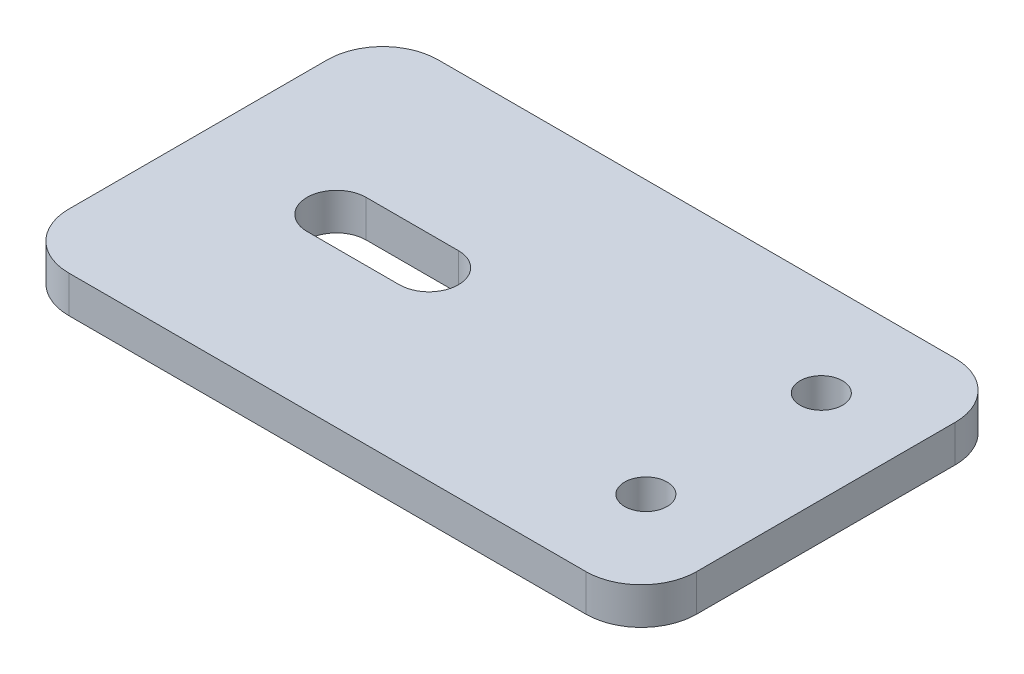
ISO-10303-21;
HEADER;
FILE_DESCRIPTION(('STEP AP214'),'2;1');
FILE_NAME('part.step','',(''),(''),'','','');
FILE_SCHEMA(('AUTOMOTIVE_DESIGN { 1 0 10303 214 1 1 1 1 }'));
ENDSEC;
DATA;
#1=APPLICATION_CONTEXT('core data for automotive mechanical design processes');
#2=APPLICATION_PROTOCOL_DEFINITION('international standard','automotive_design',2000,#1);
#3=PRODUCT_CONTEXT('',#1,'mechanical');
#4=PRODUCT('Part','Part','',(#3));
#5=PRODUCT_RELATED_PRODUCT_CATEGORY('part','',(#4));
#6=PRODUCT_DEFINITION_FORMATION('','',#4);
#7=PRODUCT_DEFINITION_CONTEXT('part definition',#1,'design');
#8=PRODUCT_DEFINITION('design','',#6,#7);
#9=PRODUCT_DEFINITION_SHAPE('','',#8);
#10=(LENGTH_UNIT() NAMED_UNIT(*) SI_UNIT(.MILLI.,.METRE.));
#11=(NAMED_UNIT(*) PLANE_ANGLE_UNIT() SI_UNIT($,.RADIAN.));
#12=(NAMED_UNIT(*) SI_UNIT($,.STERADIAN.) SOLID_ANGLE_UNIT());
#13=UNCERTAINTY_MEASURE_WITH_UNIT(LENGTH_MEASURE(1.E-05),#10,'distance_accuracy_value','');
#14=(GEOMETRIC_REPRESENTATION_CONTEXT(3) GLOBAL_UNCERTAINTY_ASSIGNED_CONTEXT((#13)) GLOBAL_UNIT_ASSIGNED_CONTEXT((#10,
#11,#12)) REPRESENTATION_CONTEXT('',''));
#15=CARTESIAN_POINT('',(0.,0.,0.));
#16=DIRECTION('',(0.,0.,1.));
#17=DIRECTION('',(1.,0.,0.));
#18=AXIS2_PLACEMENT_3D('',#15,#16,#17);
#19=CARTESIAN_POINT('',(0.,2.,0.));
#20=DIRECTION('',(0.,1.,0.));
#21=DIRECTION('',(0.,0.,1.));
#22=AXIS2_PLACEMENT_3D('',#19,#20,#21);
#23=PLANE('',#22);
#24=DIRECTION('',(1.,0.,0.));
#25=VECTOR('',#24,1.);
#26=CARTESIAN_POINT('',(2.5,2.,1.6));
#27=LINE('',#26,#25);
#28=CARTESIAN_POINT('',(-2.5,2.,1.6));
#29=VERTEX_POINT('',#28);
#30=CARTESIAN_POINT('',(2.5,2.,1.6));
#31=VERTEX_POINT('',#30);
#32=EDGE_CURVE('E137',#29,#31,#27,.T.);
#33=ORIENTED_EDGE('',*,*,#32,.F.);
#34=CARTESIAN_POINT('',(-2.5,2.,0.));
#35=DIRECTION('',(0.,1.,0.));
#36=DIRECTION('',(0.,0.,1.));
#37=AXIS2_PLACEMENT_3D('',#34,#35,#36);
#38=CIRCLE('',#37,1.6);
#39=CARTESIAN_POINT('',(-2.5,2.,-1.6));
#40=VERTEX_POINT('',#39);
#41=EDGE_CURVE('E150',#40,#29,#38,.T.);
#42=ORIENTED_EDGE('',*,*,#41,.F.);
#43=DIRECTION('',(-1.,0.,0.));
#44=VECTOR('',#43,1.);
#45=CARTESIAN_POINT('',(2.5,2.,-1.6));
#46=LINE('',#45,#44);
#47=CARTESIAN_POINT('',(2.5,2.,-1.6));
#48=VERTEX_POINT('',#47);
#49=EDGE_CURVE('E132',#48,#40,#46,.T.);
#50=ORIENTED_EDGE('',*,*,#49,.F.);
#51=CARTESIAN_POINT('',(2.5,2.,0.));
#52=DIRECTION('',(0.,1.,0.));
#53=DIRECTION('',(0.,0.,1.));
#54=AXIS2_PLACEMENT_3D('',#51,#52,#53);
#55=CIRCLE('',#54,1.6);
#56=EDGE_CURVE('E140',#31,#48,#55,.T.);
#57=ORIENTED_EDGE('',*,*,#56,.F.);
#58=EDGE_LOOP('',(#33,#42,#50,#57));
#59=FACE_BOUND('',#58,.T.);
#60=CARTESIAN_POINT('',(19.,2.,4.75));
#61=DIRECTION('',(0.,1.,0.));
#62=DIRECTION('',(0.,0.,1.));
#63=AXIS2_PLACEMENT_3D('',#60,#61,#62);
#64=CIRCLE('',#63,1.15);
#65=CARTESIAN_POINT('',(19.,2.,5.9));
#66=VERTEX_POINT('',#65);
#67=EDGE_CURVE('E170',#66,#66,#64,.T.);
#68=ORIENTED_EDGE('',*,*,#67,.F.);
#69=EDGE_LOOP('',(#68));
#70=FACE_BOUND('',#69,.T.);
#71=DIRECTION('',(-1.,0.,0.));
#72=VECTOR('',#71,1.);
#73=CARTESIAN_POINT('',(10.,2.,-10.));
#74=LINE('',#73,#72);
#75=CARTESIAN_POINT('',(21.,2.,-10.));
#76=VERTEX_POINT('',#75);
#77=CARTESIAN_POINT('',(-7.,2.,-10.));
#78=VERTEX_POINT('',#77);
#79=EDGE_CURVE('E185',#76,#78,#74,.T.);
#80=ORIENTED_EDGE('',*,*,#79,.T.);
#81=CARTESIAN_POINT('',(-7.,2.,-7.));
#82=DIRECTION('',(0.,1.,0.));
#83=DIRECTION('',(0.,0.,1.));
#84=AXIS2_PLACEMENT_3D('',#81,#82,#83);
#85=CIRCLE('',#84,3.);
#86=CARTESIAN_POINT('',(-10.,2.,-7.));
#87=VERTEX_POINT('',#86);
#88=EDGE_CURVE('E221',#78,#87,#85,.T.);
#89=ORIENTED_EDGE('',*,*,#88,.T.);
#90=DIRECTION('',(0.,0.,1.));
#91=VECTOR('',#90,1.);
#92=CARTESIAN_POINT('',(-10.,2.,-10.));
#93=LINE('',#92,#91);
#94=CARTESIAN_POINT('',(-10.,2.,7.));
#95=VERTEX_POINT('',#94);
#96=EDGE_CURVE('E176',#87,#95,#93,.T.);
#97=ORIENTED_EDGE('',*,*,#96,.T.);
#98=CARTESIAN_POINT('',(-7.,2.,6.99999999999999));
#99=DIRECTION('',(0.,1.,0.));
#100=DIRECTION('',(0.,0.,1.));
#101=AXIS2_PLACEMENT_3D('',#98,#99,#100);
#102=CIRCLE('',#101,3.);
#103=CARTESIAN_POINT('',(-7.,2.,10.));
#104=VERTEX_POINT('',#103);
#105=EDGE_CURVE('E219',#95,#104,#102,.T.);
#106=ORIENTED_EDGE('',*,*,#105,.T.);
#107=DIRECTION('',(1.,0.,0.));
#108=VECTOR('',#107,1.);
#109=CARTESIAN_POINT('',(-10.,2.,10.));
#110=LINE('',#109,#108);
#111=CARTESIAN_POINT('',(21.,2.,10.));
#112=VERTEX_POINT('',#111);
#113=EDGE_CURVE('E179',#104,#112,#110,.T.);
#114=ORIENTED_EDGE('',*,*,#113,.T.);
#115=CARTESIAN_POINT('',(21.,2.,7.));
#116=DIRECTION('',(0.,1.,0.));
#117=DIRECTION('',(0.,0.,1.));
#118=AXIS2_PLACEMENT_3D('',#115,#116,#117);
#119=CIRCLE('',#118,3.);
#120=CARTESIAN_POINT('',(24.,2.,7.));
#121=VERTEX_POINT('',#120);
#122=EDGE_CURVE('E215',#112,#121,#119,.T.);
#123=ORIENTED_EDGE('',*,*,#122,.T.);
#124=DIRECTION('',(0.,0.,-1.));
#125=VECTOR('',#124,1.);
#126=CARTESIAN_POINT('',(24.,2.,-10.));
#127=LINE('',#126,#125);
#128=CARTESIAN_POINT('',(24.,2.,-7.));
#129=VERTEX_POINT('',#128);
#130=EDGE_CURVE('E183',#121,#129,#127,.T.);
#131=ORIENTED_EDGE('',*,*,#130,.T.);
#132=CARTESIAN_POINT('',(21.,2.,-7.));
#133=DIRECTION('',(0.,1.,0.));
#134=DIRECTION('',(0.,0.,1.));
#135=AXIS2_PLACEMENT_3D('',#132,#133,#134);
#136=CIRCLE('',#135,3.);
#137=EDGE_CURVE('E217',#129,#76,#136,.T.);
#138=ORIENTED_EDGE('',*,*,#137,.T.);
#139=EDGE_LOOP('',(#80,#89,#97,#106,#114,#123,#131,#138));
#140=FACE_BOUND('',#139,.T.);
#141=CARTESIAN_POINT('',(19.,2.,-4.75));
#142=DIRECTION('',(0.,1.,0.));
#143=DIRECTION('',(0.,0.,-1.));
#144=AXIS2_PLACEMENT_3D('',#141,#142,#143);
#145=CIRCLE('',#144,1.15);
#146=CARTESIAN_POINT('',(19.,2.,-5.9));
#147=VERTEX_POINT('',#146);
#148=EDGE_CURVE('E164',#147,#147,#145,.T.);
#149=ORIENTED_EDGE('',*,*,#148,.F.);
#150=EDGE_LOOP('',(#149));
#151=FACE_BOUND('',#150,.T.);
#152=ADVANCED_FACE('F38',(#59,#70,#140,#151),#23,.T.);
#153=CARTESIAN_POINT('',(0.,0.,0.));
#154=DIRECTION('',(0.,1.,0.));
#155=DIRECTION('',(0.,0.,1.));
#156=AXIS2_PLACEMENT_3D('',#153,#154,#155);
#157=PLANE('',#156);
#158=DIRECTION('',(0.,0.,1.));
#159=VECTOR('',#158,1.);
#160=CARTESIAN_POINT('',(-10.,0.,-10.));
#161=LINE('',#160,#159);
#162=CARTESIAN_POINT('',(-10.,0.,-7.));
#163=VERTEX_POINT('',#162);
#164=CARTESIAN_POINT('',(-10.,0.,7.));
#165=VERTEX_POINT('',#164);
#166=EDGE_CURVE('E173',#163,#165,#161,.T.);
#167=ORIENTED_EDGE('',*,*,#166,.F.);
#168=CARTESIAN_POINT('',(-7.,0.,-7.));
#169=DIRECTION('',(0.,1.,0.));
#170=DIRECTION('',(0.,0.,1.));
#171=AXIS2_PLACEMENT_3D('',#168,#169,#170);
#172=CIRCLE('',#171,3.);
#173=CARTESIAN_POINT('',(-7.,0.,-10.));
#174=VERTEX_POINT('',#173);
#175=EDGE_CURVE('E208',#163,#174,#172,.F.);
#176=ORIENTED_EDGE('',*,*,#175,.T.);
#177=DIRECTION('',(-1.,0.,0.));
#178=VECTOR('',#177,1.);
#179=CARTESIAN_POINT('',(-10.,0.,-10.));
#180=LINE('',#179,#178);
#181=CARTESIAN_POINT('',(21.,0.,-10.));
#182=VERTEX_POINT('',#181);
#183=EDGE_CURVE('E180',#182,#174,#180,.T.);
#184=ORIENTED_EDGE('',*,*,#183,.F.);
#185=CARTESIAN_POINT('',(21.,0.,-7.));
#186=DIRECTION('',(0.,1.,0.));
#187=DIRECTION('',(0.,0.,1.));
#188=AXIS2_PLACEMENT_3D('',#185,#186,#187);
#189=CIRCLE('',#188,3.);
#190=CARTESIAN_POINT('',(24.,0.,-7.));
#191=VERTEX_POINT('',#190);
#192=EDGE_CURVE('E204',#182,#191,#189,.F.);
#193=ORIENTED_EDGE('',*,*,#192,.T.);
#194=DIRECTION('',(0.,0.,-1.));
#195=VECTOR('',#194,1.);
#196=CARTESIAN_POINT('',(24.,0.,-10.));
#197=LINE('',#196,#195);
#198=CARTESIAN_POINT('',(24.,0.,7.));
#199=VERTEX_POINT('',#198);
#200=EDGE_CURVE('E194',#199,#191,#197,.T.);
#201=ORIENTED_EDGE('',*,*,#200,.F.);
#202=CARTESIAN_POINT('',(21.,0.,7.));
#203=DIRECTION('',(0.,1.,0.));
#204=DIRECTION('',(0.,0.,1.));
#205=AXIS2_PLACEMENT_3D('',#202,#203,#204);
#206=CIRCLE('',#205,3.);
#207=CARTESIAN_POINT('',(21.,0.,10.));
#208=VERTEX_POINT('',#207);
#209=EDGE_CURVE('E202',#199,#208,#206,.F.);
#210=ORIENTED_EDGE('',*,*,#209,.T.);
#211=DIRECTION('',(1.,0.,0.));
#212=VECTOR('',#211,1.);
#213=CARTESIAN_POINT('',(10.,0.,10.));
#214=LINE('',#213,#212);
#215=CARTESIAN_POINT('',(-6.99999999999999,0.,9.99999999999999));
#216=VERTEX_POINT('',#215);
#217=EDGE_CURVE('E191',#216,#208,#214,.T.);
#218=ORIENTED_EDGE('',*,*,#217,.F.);
#219=CARTESIAN_POINT('',(-7.,0.,6.99999999999999));
#220=DIRECTION('',(0.,1.,0.));
#221=DIRECTION('',(0.,0.,1.));
#222=AXIS2_PLACEMENT_3D('',#219,#220,#221);
#223=CIRCLE('',#222,3.);
#224=EDGE_CURVE('E206',#216,#165,#223,.F.);
#225=ORIENTED_EDGE('',*,*,#224,.T.);
#226=EDGE_LOOP('',(#167,#176,#184,#193,#201,#210,#218,#225));
#227=FACE_BOUND('',#226,.T.);
#228=DIRECTION('',(1.,0.,0.));
#229=VECTOR('',#228,1.);
#230=CARTESIAN_POINT('',(0.,0.,1.6));
#231=LINE('',#230,#229);
#232=CARTESIAN_POINT('',(-2.5,0.,1.6));
#233=VERTEX_POINT('',#232);
#234=CARTESIAN_POINT('',(2.5,0.,1.6));
#235=VERTEX_POINT('',#234);
#236=EDGE_CURVE('E161',#233,#235,#231,.T.);
#237=ORIENTED_EDGE('',*,*,#236,.T.);
#238=CARTESIAN_POINT('',(2.5,0.,0.));
#239=DIRECTION('',(0.,1.,0.));
#240=DIRECTION('',(0.,0.,1.));
#241=AXIS2_PLACEMENT_3D('',#238,#239,#240);
#242=CIRCLE('',#241,1.6);
#243=CARTESIAN_POINT('',(2.5,0.,-1.6));
#244=VERTEX_POINT('',#243);
#245=EDGE_CURVE('E11',#235,#244,#242,.T.);
#246=ORIENTED_EDGE('',*,*,#245,.T.);
#247=DIRECTION('',(-1.,0.,0.));
#248=VECTOR('',#247,1.);
#249=CARTESIAN_POINT('',(0.,0.,-1.6));
#250=LINE('',#249,#248);
#251=CARTESIAN_POINT('',(-2.5,0.,-1.6));
#252=VERTEX_POINT('',#251);
#253=EDGE_CURVE('E52',#244,#252,#250,.T.);
#254=ORIENTED_EDGE('',*,*,#253,.T.);
#255=CARTESIAN_POINT('',(-2.5,0.,0.));
#256=DIRECTION('',(0.,1.,0.));
#257=DIRECTION('',(0.,0.,1.));
#258=AXIS2_PLACEMENT_3D('',#255,#256,#257);
#259=CIRCLE('',#258,1.6);
#260=EDGE_CURVE('E46',#252,#233,#259,.T.);
#261=ORIENTED_EDGE('',*,*,#260,.T.);
#262=EDGE_LOOP('',(#237,#246,#254,#261));
#263=FACE_BOUND('',#262,.T.);
#264=CARTESIAN_POINT('',(19.,0.,4.75));
#265=DIRECTION('',(0.,1.,0.));
#266=DIRECTION('',(0.,0.,1.));
#267=AXIS2_PLACEMENT_3D('',#264,#265,#266);
#268=CIRCLE('',#267,1.15);
#269=CARTESIAN_POINT('',(19.,0.,5.9));
#270=VERTEX_POINT('',#269);
#271=EDGE_CURVE('E167',#270,#270,#268,.T.);
#272=ORIENTED_EDGE('',*,*,#271,.T.);
#273=EDGE_LOOP('',(#272));
#274=FACE_BOUND('',#273,.T.);
#275=CARTESIAN_POINT('',(19.,0.,-4.75));
#276=DIRECTION('',(0.,1.,0.));
#277=DIRECTION('',(0.,0.,-1.));
#278=AXIS2_PLACEMENT_3D('',#275,#276,#277);
#279=CIRCLE('',#278,1.15);
#280=CARTESIAN_POINT('',(19.,0.,-5.9));
#281=VERTEX_POINT('',#280);
#282=EDGE_CURVE('E163',#281,#281,#279,.T.);
#283=ORIENTED_EDGE('',*,*,#282,.T.);
#284=EDGE_LOOP('',(#283));
#285=FACE_BOUND('',#284,.T.);
#286=ADVANCED_FACE('F232',(#227,#263,#274,#285),#157,.F.);
#287=CARTESIAN_POINT('',(-10.,2.,-10.));
#288=DIRECTION('',(1.,0.,0.));
#289=DIRECTION('',(0.,0.,-1.));
#290=AXIS2_PLACEMENT_3D('',#287,#288,#289);
#291=PLANE('',#290);
#292=ORIENTED_EDGE('',*,*,#96,.F.);
#293=DIRECTION('',(0.,-1.,0.));
#294=VECTOR('',#293,1.);
#295=CARTESIAN_POINT('',(-10.,2.,-7.));
#296=LINE('',#295,#294);
#297=EDGE_CURVE('E199',#87,#163,#296,.T.);
#298=ORIENTED_EDGE('',*,*,#297,.T.);
#299=ORIENTED_EDGE('',*,*,#166,.T.);
#300=DIRECTION('',(0.,-1.,0.));
#301=VECTOR('',#300,1.);
#302=CARTESIAN_POINT('',(-10.,2.,7.));
#303=LINE('',#302,#301);
#304=EDGE_CURVE('E188',#165,#95,#303,.F.);
#305=ORIENTED_EDGE('',*,*,#304,.T.);
#306=EDGE_LOOP('',(#292,#298,#299,#305));
#307=FACE_BOUND('',#306,.T.);
#308=ADVANCED_FACE('F252',(#307),#291,.F.);
#309=CARTESIAN_POINT('',(10.,2.,10.));
#310=DIRECTION('',(0.,0.,-1.));
#311=DIRECTION('',(-1.,0.,0.));
#312=AXIS2_PLACEMENT_3D('',#309,#310,#311);
#313=PLANE('',#312);
#314=ORIENTED_EDGE('',*,*,#113,.F.);
#315=DIRECTION('',(0.,-1.,0.));
#316=VECTOR('',#315,1.);
#317=CARTESIAN_POINT('',(-7.,2.,9.99999999999999));
#318=LINE('',#317,#316);
#319=EDGE_CURVE('E225',#104,#216,#318,.T.);
#320=ORIENTED_EDGE('',*,*,#319,.T.);
#321=ORIENTED_EDGE('',*,*,#217,.T.);
#322=DIRECTION('',(0.,-1.,0.));
#323=VECTOR('',#322,1.);
#324=CARTESIAN_POINT('',(21.,2.,10.));
#325=LINE('',#324,#323);
#326=EDGE_CURVE('E223',#208,#112,#325,.F.);
#327=ORIENTED_EDGE('',*,*,#326,.T.);
#328=EDGE_LOOP('',(#314,#320,#321,#327));
#329=FACE_BOUND('',#328,.T.);
#330=ADVANCED_FACE('F266',(#329),#313,.F.);
#331=CARTESIAN_POINT('',(24.,2.,-10.));
#332=DIRECTION('',(-1.,0.,0.));
#333=DIRECTION('',(0.,0.,1.));
#334=AXIS2_PLACEMENT_3D('',#331,#332,#333);
#335=PLANE('',#334);
#336=ORIENTED_EDGE('',*,*,#200,.T.);
#337=DIRECTION('',(0.,-1.,0.));
#338=VECTOR('',#337,1.);
#339=CARTESIAN_POINT('',(24.,2.,-7.));
#340=LINE('',#339,#338);
#341=EDGE_CURVE('E60',#191,#129,#340,.F.);
#342=ORIENTED_EDGE('',*,*,#341,.T.);
#343=ORIENTED_EDGE('',*,*,#130,.F.);
#344=DIRECTION('',(0.,-1.,0.));
#345=VECTOR('',#344,1.);
#346=CARTESIAN_POINT('',(24.,2.,7.));
#347=LINE('',#346,#345);
#348=EDGE_CURVE('E228',#121,#199,#347,.T.);
#349=ORIENTED_EDGE('',*,*,#348,.T.);
#350=EDGE_LOOP('',(#336,#342,#343,#349));
#351=FACE_BOUND('',#350,.T.);
#352=ADVANCED_FACE('F262',(#351),#335,.F.);
#353=CARTESIAN_POINT('',(-10.,2.,-10.));
#354=DIRECTION('',(0.,0.,1.));
#355=DIRECTION('',(1.,0.,0.));
#356=AXIS2_PLACEMENT_3D('',#353,#354,#355);
#357=PLANE('',#356);
#358=ORIENTED_EDGE('',*,*,#183,.T.);
#359=DIRECTION('',(0.,-1.,0.));
#360=VECTOR('',#359,1.);
#361=CARTESIAN_POINT('',(-7.,2.,-10.));
#362=LINE('',#361,#360);
#363=EDGE_CURVE('E213',#174,#78,#362,.F.);
#364=ORIENTED_EDGE('',*,*,#363,.T.);
#365=ORIENTED_EDGE('',*,*,#79,.F.);
#366=DIRECTION('',(0.,-1.,0.));
#367=VECTOR('',#366,1.);
#368=CARTESIAN_POINT('',(21.,2.,-10.));
#369=LINE('',#368,#367);
#370=EDGE_CURVE('E210',#76,#182,#369,.T.);
#371=ORIENTED_EDGE('',*,*,#370,.T.);
#372=EDGE_LOOP('',(#358,#364,#365,#371));
#373=FACE_BOUND('',#372,.T.);
#374=ADVANCED_FACE('F259',(#373),#357,.F.);
#375=CARTESIAN_POINT('',(19.,2.,4.75));
#376=DIRECTION('',(0.,-1.,0.));
#377=DIRECTION('',(0.,0.,-1.));
#378=AXIS2_PLACEMENT_3D('',#375,#376,#377);
#379=CYLINDRICAL_SURFACE('',#378,1.15);
#380=ORIENTED_EDGE('',*,*,#67,.T.);
#381=EDGE_LOOP('',(#380));
#382=FACE_BOUND('',#381,.T.);
#383=ORIENTED_EDGE('',*,*,#271,.F.);
#384=EDGE_LOOP('',(#383));
#385=FACE_BOUND('',#384,.T.);
#386=ADVANCED_FACE('F256',(#382,#385),#379,.F.);
#387=CARTESIAN_POINT('',(19.,2.,-4.75));
#388=DIRECTION('',(0.,-1.,0.));
#389=DIRECTION('',(0.,0.,-1.));
#390=AXIS2_PLACEMENT_3D('',#387,#388,#389);
#391=CYLINDRICAL_SURFACE('',#390,1.15);
#392=ORIENTED_EDGE('',*,*,#148,.T.);
#393=EDGE_LOOP('',(#392));
#394=FACE_BOUND('',#393,.T.);
#395=ORIENTED_EDGE('',*,*,#282,.F.);
#396=EDGE_LOOP('',(#395));
#397=FACE_BOUND('',#396,.T.);
#398=ADVANCED_FACE('F277',(#394,#397),#391,.F.);
#399=CARTESIAN_POINT('',(-7.,2.,-7.));
#400=DIRECTION('',(0.,-1.,0.));
#401=DIRECTION('',(0.,0.,-1.));
#402=AXIS2_PLACEMENT_3D('',#399,#400,#401);
#403=CYLINDRICAL_SURFACE('',#402,3.);
#404=ORIENTED_EDGE('',*,*,#88,.F.);
#405=ORIENTED_EDGE('',*,*,#363,.F.);
#406=ORIENTED_EDGE('',*,*,#175,.F.);
#407=ORIENTED_EDGE('',*,*,#297,.F.);
#408=EDGE_LOOP('',(#404,#405,#406,#407));
#409=FACE_BOUND('',#408,.T.);
#410=ADVANCED_FACE('F273',(#409),#403,.T.);
#411=CARTESIAN_POINT('',(-7.,2.,6.99999999999999));
#412=DIRECTION('',(0.,-1.,0.));
#413=DIRECTION('',(0.,0.,-1.));
#414=AXIS2_PLACEMENT_3D('',#411,#412,#413);
#415=CYLINDRICAL_SURFACE('',#414,3.);
#416=ORIENTED_EDGE('',*,*,#105,.F.);
#417=ORIENTED_EDGE('',*,*,#304,.F.);
#418=ORIENTED_EDGE('',*,*,#224,.F.);
#419=ORIENTED_EDGE('',*,*,#319,.F.);
#420=EDGE_LOOP('',(#416,#417,#418,#419));
#421=FACE_BOUND('',#420,.T.);
#422=ADVANCED_FACE('F276',(#421),#415,.T.);
#423=CARTESIAN_POINT('',(21.,2.,-7.));
#424=DIRECTION('',(0.,-1.,0.));
#425=DIRECTION('',(0.,0.,-1.));
#426=AXIS2_PLACEMENT_3D('',#423,#424,#425);
#427=CYLINDRICAL_SURFACE('',#426,3.);
#428=ORIENTED_EDGE('',*,*,#137,.F.);
#429=ORIENTED_EDGE('',*,*,#341,.F.);
#430=ORIENTED_EDGE('',*,*,#192,.F.);
#431=ORIENTED_EDGE('',*,*,#370,.F.);
#432=EDGE_LOOP('',(#428,#429,#430,#431));
#433=FACE_BOUND('',#432,.T.);
#434=ADVANCED_FACE('F280',(#433),#427,.T.);
#435=CARTESIAN_POINT('',(21.,2.,7.));
#436=DIRECTION('',(0.,-1.,0.));
#437=DIRECTION('',(0.,0.,-1.));
#438=AXIS2_PLACEMENT_3D('',#435,#436,#437);
#439=CYLINDRICAL_SURFACE('',#438,3.);
#440=ORIENTED_EDGE('',*,*,#122,.F.);
#441=ORIENTED_EDGE('',*,*,#326,.F.);
#442=ORIENTED_EDGE('',*,*,#209,.F.);
#443=ORIENTED_EDGE('',*,*,#348,.F.);
#444=EDGE_LOOP('',(#440,#441,#442,#443));
#445=FACE_BOUND('',#444,.T.);
#446=ADVANCED_FACE('F40',(#445),#439,.T.);
#447=CARTESIAN_POINT('',(2.5,-8.,0.));
#448=DIRECTION('',(0.,1.,0.));
#449=DIRECTION('',(0.,0.,1.));
#450=AXIS2_PLACEMENT_3D('',#447,#448,#449);
#451=CYLINDRICAL_SURFACE('',#450,1.6);
#452=DIRECTION('',(0.,1.,0.));
#453=VECTOR('',#452,1.);
#454=CARTESIAN_POINT('',(2.5,-8.,1.6));
#455=LINE('',#454,#453);
#456=EDGE_CURVE('E143',#235,#31,#455,.T.);
#457=ORIENTED_EDGE('',*,*,#456,.T.);
#458=ORIENTED_EDGE('',*,*,#56,.T.);
#459=DIRECTION('',(0.,1.,0.));
#460=VECTOR('',#459,1.);
#461=CARTESIAN_POINT('',(2.5,-8.,-1.6));
#462=LINE('',#461,#460);
#463=EDGE_CURVE('E128',#244,#48,#462,.T.);
#464=ORIENTED_EDGE('',*,*,#463,.F.);
#465=ORIENTED_EDGE('',*,*,#245,.F.);
#466=EDGE_LOOP('',(#457,#458,#464,#465));
#467=FACE_BOUND('',#466,.T.);
#468=ADVANCED_FACE('F141',(#467),#451,.F.);
#469=CARTESIAN_POINT('',(-2.5,-8.,0.));
#470=DIRECTION('',(0.,1.,0.));
#471=DIRECTION('',(0.,0.,1.));
#472=AXIS2_PLACEMENT_3D('',#469,#470,#471);
#473=CYLINDRICAL_SURFACE('',#472,1.6);
#474=DIRECTION('',(0.,1.,0.));
#475=VECTOR('',#474,1.);
#476=CARTESIAN_POINT('',(-2.5,-8.,-1.6));
#477=LINE('',#476,#475);
#478=EDGE_CURVE('E136',#252,#40,#477,.T.);
#479=ORIENTED_EDGE('',*,*,#478,.T.);
#480=ORIENTED_EDGE('',*,*,#41,.T.);
#481=DIRECTION('',(0.,1.,0.));
#482=VECTOR('',#481,1.);
#483=CARTESIAN_POINT('',(-2.5,-8.,1.6));
#484=LINE('',#483,#482);
#485=EDGE_CURVE('E156',#233,#29,#484,.T.);
#486=ORIENTED_EDGE('',*,*,#485,.F.);
#487=ORIENTED_EDGE('',*,*,#260,.F.);
#488=EDGE_LOOP('',(#479,#480,#486,#487));
#489=FACE_BOUND('',#488,.T.);
#490=ADVANCED_FACE('F236',(#489),#473,.F.);
#491=CARTESIAN_POINT('',(2.5,-8.,1.6));
#492=DIRECTION('',(0.,0.,1.));
#493=DIRECTION('',(1.,0.,0.));
#494=AXIS2_PLACEMENT_3D('',#491,#492,#493);
#495=PLANE('',#494);
#496=ORIENTED_EDGE('',*,*,#485,.T.);
#497=ORIENTED_EDGE('',*,*,#32,.T.);
#498=ORIENTED_EDGE('',*,*,#456,.F.);
#499=ORIENTED_EDGE('',*,*,#236,.F.);
#500=EDGE_LOOP('',(#496,#497,#498,#499));
#501=FACE_BOUND('',#500,.T.);
#502=ADVANCED_FACE('F238',(#501),#495,.F.);
#503=CARTESIAN_POINT('',(2.5,-8.,-1.6));
#504=DIRECTION('',(0.,0.,-1.));
#505=DIRECTION('',(-1.,0.,0.));
#506=AXIS2_PLACEMENT_3D('',#503,#504,#505);
#507=PLANE('',#506);
#508=ORIENTED_EDGE('',*,*,#463,.T.);
#509=ORIENTED_EDGE('',*,*,#49,.T.);
#510=ORIENTED_EDGE('',*,*,#478,.F.);
#511=ORIENTED_EDGE('',*,*,#253,.F.);
#512=EDGE_LOOP('',(#508,#509,#510,#511));
#513=FACE_BOUND('',#512,.T.);
#514=ADVANCED_FACE('F130',(#513),#507,.F.);
#515=CLOSED_SHELL('',(#152,#286,#308,#330,#352,#374,#386,#398,#410,#422,#434,#446,#468,#490,
#502,#514));
#516=MANIFOLD_SOLID_BREP('B2',#515);
#517=ADVANCED_BREP_SHAPE_REPRESENTATION('',(#18,#516),#14);
#518=SHAPE_DEFINITION_REPRESENTATION(#9,#517);
ENDSEC;
END-ISO-10303-21;
